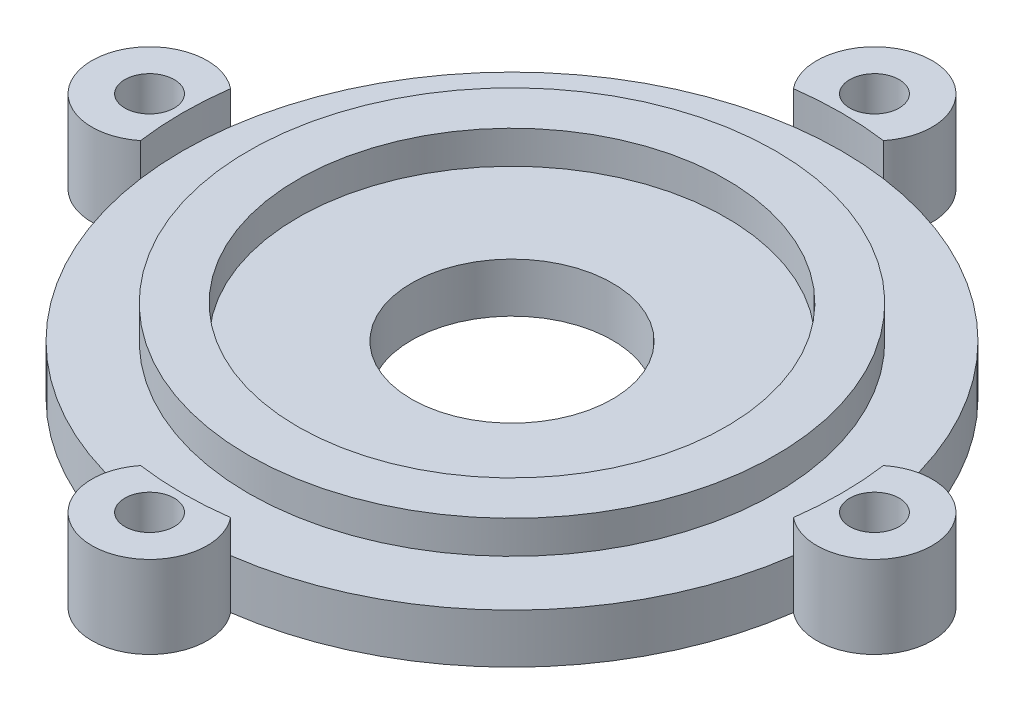
ISO-10303-21;
HEADER;
FILE_DESCRIPTION(('STEP AP214'),'2;1');
FILE_NAME('part.step','',(''),(''),'','','');
FILE_SCHEMA(('AUTOMOTIVE_DESIGN { 1 0 10303 214 1 1 1 1 }'));
ENDSEC;
DATA;
#1=APPLICATION_CONTEXT('core data for automotive mechanical design processes');
#2=APPLICATION_PROTOCOL_DEFINITION('international standard','automotive_design',2000,#1);
#3=PRODUCT_CONTEXT('',#1,'mechanical');
#4=PRODUCT('Part','Part','',(#3));
#5=PRODUCT_RELATED_PRODUCT_CATEGORY('part','',(#4));
#6=PRODUCT_DEFINITION_FORMATION('','',#4);
#7=PRODUCT_DEFINITION_CONTEXT('part definition',#1,'design');
#8=PRODUCT_DEFINITION('design','',#6,#7);
#9=PRODUCT_DEFINITION_SHAPE('','',#8);
#10=(LENGTH_UNIT() NAMED_UNIT(*) SI_UNIT(.MILLI.,.METRE.));
#11=(NAMED_UNIT(*) PLANE_ANGLE_UNIT() SI_UNIT($,.RADIAN.));
#12=(NAMED_UNIT(*) SI_UNIT($,.STERADIAN.) SOLID_ANGLE_UNIT());
#13=UNCERTAINTY_MEASURE_WITH_UNIT(LENGTH_MEASURE(1.E-05),#10,'distance_accuracy_value','');
#14=(GEOMETRIC_REPRESENTATION_CONTEXT(3) GLOBAL_UNCERTAINTY_ASSIGNED_CONTEXT((#13)) GLOBAL_UNIT_ASSIGNED_CONTEXT((#10,
#11,#12)) REPRESENTATION_CONTEXT('',''));
#15=CARTESIAN_POINT('',(0.,0.,0.));
#16=DIRECTION('',(0.,0.,1.));
#17=DIRECTION('',(1.,0.,0.));
#18=AXIS2_PLACEMENT_3D('',#15,#16,#17);
#19=CARTESIAN_POINT('',(0.,3.,0.));
#20=DIRECTION('',(0.,1.,0.));
#21=DIRECTION('',(0.,0.,1.));
#22=AXIS2_PLACEMENT_3D('',#19,#20,#21);
#23=PLANE('',#22);
#24=CARTESIAN_POINT('',(0.,3.,0.));
#25=DIRECTION('',(0.,1.,0.));
#26=DIRECTION('',(0.,0.,1.));
#27=AXIS2_PLACEMENT_3D('',#24,#25,#26);
#28=CIRCLE('',#27,16.);
#29=CARTESIAN_POINT('',(0.,3.,16.));
#30=VERTEX_POINT('',#29);
#31=EDGE_CURVE('E451',#30,#30,#28,.T.);
#32=ORIENTED_EDGE('',*,*,#31,.F.);
#33=EDGE_LOOP('',(#32));
#34=FACE_BOUND('',#33,.T.);
#35=CARTESIAN_POINT('',(0.,3.,0.));
#36=DIRECTION('',(0.,1.,0.));
#37=DIRECTION('',(0.,0.,1.));
#38=AXIS2_PLACEMENT_3D('',#35,#36,#37);
#39=CIRCLE('',#38,20.);
#40=CARTESIAN_POINT('',(-19.8125,3.,-2.73218662429926));
#41=VERTEX_POINT('',#40);
#42=CARTESIAN_POINT('',(-19.8125,3.,2.73218662429921));
#43=VERTEX_POINT('',#42);
#44=EDGE_CURVE('E103',#41,#43,#39,.T.);
#45=ORIENTED_EDGE('',*,*,#44,.T.);
#46=CARTESIAN_POINT('',(0.,3.,0.));
#47=DIRECTION('',(0.,1.,0.));
#48=DIRECTION('',(0.,0.,1.));
#49=AXIS2_PLACEMENT_3D('',#46,#47,#48);
#50=CIRCLE('',#49,20.);
#51=CARTESIAN_POINT('',(-2.73218662429929,3.,19.8125));
#52=VERTEX_POINT('',#51);
#53=EDGE_CURVE('E281',#43,#52,#50,.T.);
#54=ORIENTED_EDGE('',*,*,#53,.T.);
#55=CARTESIAN_POINT('',(0.,3.,0.));
#56=DIRECTION('',(0.,1.,0.));
#57=DIRECTION('',(0.,0.,1.));
#58=AXIS2_PLACEMENT_3D('',#55,#56,#57);
#59=CIRCLE('',#58,20.);
#60=CARTESIAN_POINT('',(2.73218662429922,3.,19.8125));
#61=VERTEX_POINT('',#60);
#62=EDGE_CURVE('E260',#52,#61,#59,.T.);
#63=ORIENTED_EDGE('',*,*,#62,.T.);
#64=CARTESIAN_POINT('',(19.8125,3.,2.73218662429931));
#65=VERTEX_POINT('',#64);
#66=EDGE_CURVE('E275',#61,#65,#50,.T.);
#67=ORIENTED_EDGE('',*,*,#66,.T.);
#68=CARTESIAN_POINT('',(0.,3.,0.));
#69=DIRECTION('',(0.,1.,0.));
#70=DIRECTION('',(0.,0.,1.));
#71=AXIS2_PLACEMENT_3D('',#68,#69,#70);
#72=CIRCLE('',#71,20.);
#73=CARTESIAN_POINT('',(19.8125,3.,-2.73218662429928));
#74=VERTEX_POINT('',#73);
#75=EDGE_CURVE('E238',#65,#74,#72,.T.);
#76=ORIENTED_EDGE('',*,*,#75,.T.);
#77=CARTESIAN_POINT('',(2.73218662429928,3.,-19.8125));
#78=VERTEX_POINT('',#77);
#79=EDGE_CURVE('E279',#74,#78,#50,.T.);
#80=ORIENTED_EDGE('',*,*,#79,.T.);
#81=CARTESIAN_POINT('',(0.,3.,0.));
#82=DIRECTION('',(0.,1.,0.));
#83=DIRECTION('',(0.,0.,1.));
#84=AXIS2_PLACEMENT_3D('',#81,#82,#83);
#85=CIRCLE('',#84,20.);
#86=CARTESIAN_POINT('',(-2.73218662429926,3.,-19.8125));
#87=VERTEX_POINT('',#86);
#88=EDGE_CURVE('E216',#78,#87,#85,.T.);
#89=ORIENTED_EDGE('',*,*,#88,.T.);
#90=EDGE_CURVE('E468',#87,#41,#50,.T.);
#91=ORIENTED_EDGE('',*,*,#90,.T.);
#92=EDGE_LOOP('',(#45,#54,#63,#67,#76,#80,#89,#91));
#93=FACE_BOUND('',#92,.T.);
#94=ADVANCED_FACE('F84',(#34,#93),#23,.T.);
#95=CARTESIAN_POINT('',(0.,3.,22.));
#96=DIRECTION('',(0.,-1.,0.));
#97=DIRECTION('',(0.,0.,-1.));
#98=AXIS2_PLACEMENT_3D('',#95,#96,#97);
#99=CYLINDRICAL_SURFACE('',#98,3.49999999999997);
#100=CARTESIAN_POINT('',(0.,0.,22.));
#101=DIRECTION('',(0.,1.,0.));
#102=DIRECTION('',(0.,0.,1.));
#103=AXIS2_PLACEMENT_3D('',#100,#101,#102);
#104=CIRCLE('',#103,3.49999999999997);
#105=CARTESIAN_POINT('',(2.73218662429922,0.,19.8125));
#106=VERTEX_POINT('',#105);
#107=CARTESIAN_POINT('',(-2.73218662429927,0.,19.8125));
#108=VERTEX_POINT('',#107);
#109=EDGE_CURVE('E285',#106,#108,#104,.F.);
#110=ORIENTED_EDGE('',*,*,#109,.F.);
#111=DIRECTION('',(0.,-1.,0.));
#112=VECTOR('',#111,1.);
#113=CARTESIAN_POINT('',(2.73218662429922,3.,19.8125));
#114=LINE('',#113,#112);
#115=EDGE_CURVE('E95',#61,#106,#114,.T.);
#116=ORIENTED_EDGE('',*,*,#115,.F.);
#117=DIRECTION('',(0.,-1.,0.));
#118=VECTOR('',#117,1.);
#119=CARTESIAN_POINT('',(2.73218662429925,5.,19.8125));
#120=LINE('',#119,#118);
#121=CARTESIAN_POINT('',(2.73218662429925,5.,19.8125));
#122=VERTEX_POINT('',#121);
#123=EDGE_CURVE('E149',#122,#61,#120,.T.);
#124=ORIENTED_EDGE('',*,*,#123,.F.);
#125=CARTESIAN_POINT('',(0.,5.,22.));
#126=DIRECTION('',(0.,1.,0.));
#127=DIRECTION('',(0.,0.,1.));
#128=AXIS2_PLACEMENT_3D('',#125,#126,#127);
#129=CIRCLE('',#128,3.49999999999997);
#130=CARTESIAN_POINT('',(-2.73218662429929,5.,19.8125));
#131=VERTEX_POINT('',#130);
#132=EDGE_CURVE('E261',#131,#122,#129,.T.);
#133=ORIENTED_EDGE('',*,*,#132,.F.);
#134=DIRECTION('',(0.,-1.,0.));
#135=VECTOR('',#134,1.);
#136=CARTESIAN_POINT('',(-2.73218662429929,5.,19.8125));
#137=LINE('',#136,#135);
#138=EDGE_CURVE('E267',#131,#52,#137,.T.);
#139=ORIENTED_EDGE('',*,*,#138,.T.);
#140=DIRECTION('',(0.,-1.,0.));
#141=VECTOR('',#140,1.);
#142=CARTESIAN_POINT('',(-2.73218662429927,3.,19.8125));
#143=LINE('',#142,#141);
#144=EDGE_CURVE('E142',#52,#108,#143,.T.);
#145=ORIENTED_EDGE('',*,*,#144,.T.);
#146=EDGE_LOOP('',(#110,#116,#124,#133,#139,#145));
#147=FACE_BOUND('',#146,.T.);
#148=ADVANCED_FACE('F350',(#147),#99,.T.);
#149=CARTESIAN_POINT('',(0.,3.,0.));
#150=DIRECTION('',(0.,-1.,0.));
#151=DIRECTION('',(0.,0.,-1.));
#152=AXIS2_PLACEMENT_3D('',#149,#150,#151);
#153=CYLINDRICAL_SURFACE('',#152,20.);
#154=CARTESIAN_POINT('',(0.,0.,0.));
#155=DIRECTION('',(0.,1.,0.));
#156=DIRECTION('',(0.,0.,1.));
#157=AXIS2_PLACEMENT_3D('',#154,#155,#156);
#158=CIRCLE('',#157,20.);
#159=CARTESIAN_POINT('',(19.8125,0.,2.73218662429931));
#160=VERTEX_POINT('',#159);
#161=EDGE_CURVE('E289',#106,#160,#158,.T.);
#162=ORIENTED_EDGE('',*,*,#161,.T.);
#163=DIRECTION('',(0.,-1.,0.));
#164=VECTOR('',#163,1.);
#165=CARTESIAN_POINT('',(19.8125,3.,2.73218662429931));
#166=LINE('',#165,#164);
#167=EDGE_CURVE('E335',#65,#160,#166,.T.);
#168=ORIENTED_EDGE('',*,*,#167,.F.);
#169=ORIENTED_EDGE('',*,*,#66,.F.);
#170=ORIENTED_EDGE('',*,*,#115,.T.);
#171=EDGE_LOOP('',(#162,#168,#169,#170));
#172=FACE_BOUND('',#171,.T.);
#173=ADVANCED_FACE('F343',(#172),#153,.T.);
#174=CARTESIAN_POINT('',(22.,3.,0.));
#175=DIRECTION('',(0.,-1.,0.));
#176=DIRECTION('',(0.,0.,-1.));
#177=AXIS2_PLACEMENT_3D('',#174,#175,#176);
#178=CYLINDRICAL_SURFACE('',#177,3.49999999999999);
#179=CARTESIAN_POINT('',(22.,0.,0.));
#180=DIRECTION('',(0.,1.,0.));
#181=DIRECTION('',(0.,0.,1.));
#182=AXIS2_PLACEMENT_3D('',#179,#180,#181);
#183=CIRCLE('',#182,3.49999999999999);
#184=CARTESIAN_POINT('',(19.8125,0.,-2.73218662429928));
#185=VERTEX_POINT('',#184);
#186=EDGE_CURVE('E293',#185,#160,#183,.F.);
#187=ORIENTED_EDGE('',*,*,#186,.F.);
#188=DIRECTION('',(0.,-1.,0.));
#189=VECTOR('',#188,1.);
#190=CARTESIAN_POINT('',(19.8125,3.,-2.73218662429928));
#191=LINE('',#190,#189);
#192=EDGE_CURVE('E332',#74,#185,#191,.T.);
#193=ORIENTED_EDGE('',*,*,#192,.F.);
#194=DIRECTION('',(0.,-1.,0.));
#195=VECTOR('',#194,1.);
#196=CARTESIAN_POINT('',(19.8125,5.,-2.73218662429928));
#197=LINE('',#196,#195);
#198=CARTESIAN_POINT('',(19.8125,5.,-2.73218662429928));
#199=VERTEX_POINT('',#198);
#200=EDGE_CURVE('E253',#199,#74,#197,.T.);
#201=ORIENTED_EDGE('',*,*,#200,.F.);
#202=CARTESIAN_POINT('',(22.,5.,0.));
#203=DIRECTION('',(0.,1.,0.));
#204=DIRECTION('',(0.,0.,1.));
#205=AXIS2_PLACEMENT_3D('',#202,#203,#204);
#206=CIRCLE('',#205,3.49999999999999);
#207=CARTESIAN_POINT('',(19.8125,5.,2.7321866242993));
#208=VERTEX_POINT('',#207);
#209=EDGE_CURVE('E239',#208,#199,#206,.T.);
#210=ORIENTED_EDGE('',*,*,#209,.F.);
#211=DIRECTION('',(0.,-1.,0.));
#212=VECTOR('',#211,1.);
#213=CARTESIAN_POINT('',(19.8125,5.,2.7321866242993));
#214=LINE('',#213,#212);
#215=EDGE_CURVE('E246',#208,#65,#214,.T.);
#216=ORIENTED_EDGE('',*,*,#215,.T.);
#217=ORIENTED_EDGE('',*,*,#167,.T.);
#218=EDGE_LOOP('',(#187,#193,#201,#210,#216,#217));
#219=FACE_BOUND('',#218,.T.);
#220=ADVANCED_FACE('F356',(#219),#178,.T.);
#221=CARTESIAN_POINT('',(2.73218662429928,0.,-19.8125));
#222=VERTEX_POINT('',#221);
#223=EDGE_CURVE('E295',#185,#222,#158,.T.);
#224=ORIENTED_EDGE('',*,*,#223,.T.);
#225=DIRECTION('',(0.,-1.,0.));
#226=VECTOR('',#225,1.);
#227=CARTESIAN_POINT('',(2.73218662429928,3.,-19.8125));
#228=LINE('',#227,#226);
#229=EDGE_CURVE('E329',#78,#222,#228,.T.);
#230=ORIENTED_EDGE('',*,*,#229,.F.);
#231=ORIENTED_EDGE('',*,*,#79,.F.);
#232=ORIENTED_EDGE('',*,*,#192,.T.);
#233=EDGE_LOOP('',(#224,#230,#231,#232));
#234=FACE_BOUND('',#233,.T.);
#235=ADVANCED_FACE('F358',(#234),#153,.T.);
#236=CARTESIAN_POINT('',(0.,3.,-22.));
#237=DIRECTION('',(0.,-1.,0.));
#238=DIRECTION('',(0.,0.,-1.));
#239=AXIS2_PLACEMENT_3D('',#236,#237,#238);
#240=CYLINDRICAL_SURFACE('',#239,3.49999999999997);
#241=CARTESIAN_POINT('',(0.,0.,-22.));
#242=DIRECTION('',(0.,1.,0.));
#243=DIRECTION('',(0.,0.,1.));
#244=AXIS2_PLACEMENT_3D('',#241,#242,#243);
#245=CIRCLE('',#244,3.49999999999997);
#246=CARTESIAN_POINT('',(-2.73218662429928,0.,-19.8125));
#247=VERTEX_POINT('',#246);
#248=EDGE_CURVE('E299',#247,#222,#245,.F.);
#249=ORIENTED_EDGE('',*,*,#248,.F.);
#250=DIRECTION('',(0.,-1.,0.));
#251=VECTOR('',#250,1.);
#252=CARTESIAN_POINT('',(-2.73218662429928,3.,-19.8125));
#253=LINE('',#252,#251);
#254=EDGE_CURVE('E326',#87,#247,#253,.T.);
#255=ORIENTED_EDGE('',*,*,#254,.F.);
#256=DIRECTION('',(0.,-1.,0.));
#257=VECTOR('',#256,1.);
#258=CARTESIAN_POINT('',(-2.73218662429926,5.,-19.8125));
#259=LINE('',#258,#257);
#260=CARTESIAN_POINT('',(-2.73218662429926,5.,-19.8125));
#261=VERTEX_POINT('',#260);
#262=EDGE_CURVE('E231',#261,#87,#259,.T.);
#263=ORIENTED_EDGE('',*,*,#262,.F.);
#264=CARTESIAN_POINT('',(0.,5.,-22.));
#265=DIRECTION('',(0.,1.,0.));
#266=DIRECTION('',(0.,0.,1.));
#267=AXIS2_PLACEMENT_3D('',#264,#265,#266);
#268=CIRCLE('',#267,3.49999999999997);
#269=CARTESIAN_POINT('',(2.73218662429927,5.,-19.8125));
#270=VERTEX_POINT('',#269);
#271=EDGE_CURVE('E217',#270,#261,#268,.T.);
#272=ORIENTED_EDGE('',*,*,#271,.F.);
#273=DIRECTION('',(0.,-1.,0.));
#274=VECTOR('',#273,1.);
#275=CARTESIAN_POINT('',(2.73218662429927,5.,-19.8125));
#276=LINE('',#275,#274);
#277=EDGE_CURVE('E224',#270,#78,#276,.T.);
#278=ORIENTED_EDGE('',*,*,#277,.T.);
#279=ORIENTED_EDGE('',*,*,#229,.T.);
#280=EDGE_LOOP('',(#249,#255,#263,#272,#278,#279));
#281=FACE_BOUND('',#280,.T.);
#282=ADVANCED_FACE('F367',(#281),#240,.T.);
#283=CARTESIAN_POINT('',(-19.8125,0.,-2.73218662429926));
#284=VERTEX_POINT('',#283);
#285=EDGE_CURVE('E303',#247,#284,#158,.T.);
#286=ORIENTED_EDGE('',*,*,#285,.T.);
#287=DIRECTION('',(0.,-1.,0.));
#288=VECTOR('',#287,1.);
#289=CARTESIAN_POINT('',(-19.8125,3.,-2.73218662429926));
#290=LINE('',#289,#288);
#291=EDGE_CURVE('E323',#41,#284,#290,.T.);
#292=ORIENTED_EDGE('',*,*,#291,.F.);
#293=ORIENTED_EDGE('',*,*,#90,.F.);
#294=ORIENTED_EDGE('',*,*,#254,.T.);
#295=EDGE_LOOP('',(#286,#292,#293,#294));
#296=FACE_BOUND('',#295,.T.);
#297=ADVANCED_FACE('F370',(#296),#153,.T.);
#298=CARTESIAN_POINT('',(-22.,3.,0.));
#299=DIRECTION('',(0.,-1.,0.));
#300=DIRECTION('',(0.,0.,-1.));
#301=AXIS2_PLACEMENT_3D('',#298,#299,#300);
#302=CYLINDRICAL_SURFACE('',#301,3.49999999999997);
#303=CARTESIAN_POINT('',(-22.,0.,0.));
#304=DIRECTION('',(0.,1.,0.));
#305=DIRECTION('',(0.,0.,1.));
#306=AXIS2_PLACEMENT_3D('',#303,#304,#305);
#307=CIRCLE('',#306,3.49999999999997);
#308=CARTESIAN_POINT('',(-19.8125,0.,2.73218662429923));
#309=VERTEX_POINT('',#308);
#310=EDGE_CURVE('E304',#309,#284,#307,.F.);
#311=ORIENTED_EDGE('',*,*,#310,.F.);
#312=DIRECTION('',(0.,-1.,0.));
#313=VECTOR('',#312,1.);
#314=CARTESIAN_POINT('',(-19.8125,3.,2.73218662429923));
#315=LINE('',#314,#313);
#316=EDGE_CURVE('E134',#43,#309,#315,.T.);
#317=ORIENTED_EDGE('',*,*,#316,.F.);
#318=DIRECTION('',(0.,-1.,0.));
#319=VECTOR('',#318,1.);
#320=CARTESIAN_POINT('',(-19.8125,5.,2.73218662429921));
#321=LINE('',#320,#319);
#322=CARTESIAN_POINT('',(-19.8125,5.,2.73218662429921));
#323=VERTEX_POINT('',#322);
#324=EDGE_CURVE('E196',#323,#43,#321,.T.);
#325=ORIENTED_EDGE('',*,*,#324,.F.);
#326=CARTESIAN_POINT('',(-22.,5.,0.));
#327=DIRECTION('',(0.,1.,0.));
#328=DIRECTION('',(0.,0.,1.));
#329=AXIS2_PLACEMENT_3D('',#326,#327,#328);
#330=CIRCLE('',#329,3.49999999999997);
#331=CARTESIAN_POINT('',(-19.8125,5.,-2.73218662429925));
#332=VERTEX_POINT('',#331);
#333=EDGE_CURVE('E187',#332,#323,#330,.T.);
#334=ORIENTED_EDGE('',*,*,#333,.F.);
#335=DIRECTION('',(0.,-1.,0.));
#336=VECTOR('',#335,1.);
#337=CARTESIAN_POINT('',(-19.8125,5.,-2.73218662429925));
#338=LINE('',#337,#336);
#339=EDGE_CURVE('E201',#332,#41,#338,.T.);
#340=ORIENTED_EDGE('',*,*,#339,.T.);
#341=ORIENTED_EDGE('',*,*,#291,.T.);
#342=EDGE_LOOP('',(#311,#317,#325,#334,#340,#341));
#343=FACE_BOUND('',#342,.T.);
#344=ADVANCED_FACE('F198',(#343),#302,.T.);
#345=CARTESIAN_POINT('',(0.,3.,-22.));
#346=DIRECTION('',(0.,-1.,0.));
#347=DIRECTION('',(0.,0.,-1.));
#348=AXIS2_PLACEMENT_3D('',#345,#346,#347);
#349=CYLINDRICAL_SURFACE('',#348,1.5);
#350=CARTESIAN_POINT('',(0.,0.,-22.));
#351=DIRECTION('',(0.,1.,0.));
#352=DIRECTION('',(0.,0.,1.));
#353=AXIS2_PLACEMENT_3D('',#350,#351,#352);
#354=CIRCLE('',#353,1.5);
#355=CARTESIAN_POINT('',(0.,0.,-20.5));
#356=VERTEX_POINT('',#355);
#357=EDGE_CURVE('E312',#356,#356,#354,.T.);
#358=ORIENTED_EDGE('',*,*,#357,.F.);
#359=EDGE_LOOP('',(#358));
#360=FACE_BOUND('',#359,.T.);
#361=CARTESIAN_POINT('',(0.,5.,-22.));
#362=DIRECTION('',(0.,1.,0.));
#363=DIRECTION('',(0.,0.,1.));
#364=AXIS2_PLACEMENT_3D('',#361,#362,#363);
#365=CIRCLE('',#364,1.5);
#366=CARTESIAN_POINT('',(0.,5.,-20.5));
#367=VERTEX_POINT('',#366);
#368=EDGE_CURVE('E200',#367,#367,#365,.T.);
#369=ORIENTED_EDGE('',*,*,#368,.T.);
#370=EDGE_LOOP('',(#369));
#371=FACE_BOUND('',#370,.T.);
#372=ADVANCED_FACE('F373',(#360,#371),#349,.F.);
#373=CARTESIAN_POINT('',(-22.,3.,0.));
#374=DIRECTION('',(0.,-1.,0.));
#375=DIRECTION('',(0.,0.,-1.));
#376=AXIS2_PLACEMENT_3D('',#373,#374,#375);
#377=CYLINDRICAL_SURFACE('',#376,1.49999999999997);
#378=CARTESIAN_POINT('',(-22.,0.,0.));
#379=DIRECTION('',(0.,1.,0.));
#380=DIRECTION('',(0.,0.,1.));
#381=AXIS2_PLACEMENT_3D('',#378,#379,#380);
#382=CIRCLE('',#381,1.49999999999997);
#383=CARTESIAN_POINT('',(-22.,0.,1.49999999999995));
#384=VERTEX_POINT('',#383);
#385=EDGE_CURVE('E308',#384,#384,#382,.T.);
#386=ORIENTED_EDGE('',*,*,#385,.F.);
#387=EDGE_LOOP('',(#386));
#388=FACE_BOUND('',#387,.T.);
#389=CARTESIAN_POINT('',(-22.,5.,0.));
#390=DIRECTION('',(0.,1.,0.));
#391=DIRECTION('',(0.,0.,1.));
#392=AXIS2_PLACEMENT_3D('',#389,#390,#391);
#393=CIRCLE('',#392,1.49999999999997);
#394=CARTESIAN_POINT('',(-22.,5.,1.49999999999995));
#395=VERTEX_POINT('',#394);
#396=EDGE_CURVE('E211',#395,#395,#393,.T.);
#397=ORIENTED_EDGE('',*,*,#396,.T.);
#398=EDGE_LOOP('',(#397));
#399=FACE_BOUND('',#398,.T.);
#400=ADVANCED_FACE('F376',(#388,#399),#377,.F.);
#401=EDGE_CURVE('E294',#309,#108,#158,.T.);
#402=ORIENTED_EDGE('',*,*,#401,.T.);
#403=ORIENTED_EDGE('',*,*,#144,.F.);
#404=ORIENTED_EDGE('',*,*,#53,.F.);
#405=ORIENTED_EDGE('',*,*,#316,.T.);
#406=EDGE_LOOP('',(#402,#403,#404,#405));
#407=FACE_BOUND('',#406,.T.);
#408=ADVANCED_FACE('F359',(#407),#153,.T.);
#409=CARTESIAN_POINT('',(0.,3.,22.));
#410=DIRECTION('',(0.,-1.,0.));
#411=DIRECTION('',(0.,0.,-1.));
#412=AXIS2_PLACEMENT_3D('',#409,#410,#411);
#413=CYLINDRICAL_SURFACE('',#412,1.5);
#414=CARTESIAN_POINT('',(0.,0.,22.));
#415=DIRECTION('',(0.,1.,0.));
#416=DIRECTION('',(0.,0.,1.));
#417=AXIS2_PLACEMENT_3D('',#414,#415,#416);
#418=CIRCLE('',#417,1.5);
#419=CARTESIAN_POINT('',(0.,0.,23.5));
#420=VERTEX_POINT('',#419);
#421=EDGE_CURVE('E274',#420,#420,#418,.T.);
#422=ORIENTED_EDGE('',*,*,#421,.F.);
#423=EDGE_LOOP('',(#422));
#424=FACE_BOUND('',#423,.T.);
#425=CARTESIAN_POINT('',(0.,5.,22.));
#426=DIRECTION('',(0.,1.,0.));
#427=DIRECTION('',(0.,0.,1.));
#428=AXIS2_PLACEMENT_3D('',#425,#426,#427);
#429=CIRCLE('',#428,1.5);
#430=CARTESIAN_POINT('',(0.,5.,23.5));
#431=VERTEX_POINT('',#430);
#432=EDGE_CURVE('E256',#431,#431,#429,.T.);
#433=ORIENTED_EDGE('',*,*,#432,.T.);
#434=EDGE_LOOP('',(#433));
#435=FACE_BOUND('',#434,.T.);
#436=ADVANCED_FACE('F86',(#424,#435),#413,.F.);
#437=CARTESIAN_POINT('',(22.,3.,0.));
#438=DIRECTION('',(0.,-1.,0.));
#439=DIRECTION('',(0.,0.,-1.));
#440=AXIS2_PLACEMENT_3D('',#437,#438,#439);
#441=CYLINDRICAL_SURFACE('',#440,1.5);
#442=CARTESIAN_POINT('',(22.,0.,0.));
#443=DIRECTION('',(0.,1.,0.));
#444=DIRECTION('',(0.,0.,1.));
#445=AXIS2_PLACEMENT_3D('',#442,#443,#444);
#446=CIRCLE('',#445,1.5);
#447=CARTESIAN_POINT('',(22.,0.,1.50000000000001));
#448=VERTEX_POINT('',#447);
#449=EDGE_CURVE('E280',#448,#448,#446,.T.);
#450=ORIENTED_EDGE('',*,*,#449,.F.);
#451=EDGE_LOOP('',(#450));
#452=FACE_BOUND('',#451,.T.);
#453=CARTESIAN_POINT('',(22.,5.,0.));
#454=DIRECTION('',(0.,1.,0.));
#455=DIRECTION('',(0.,0.,1.));
#456=AXIS2_PLACEMENT_3D('',#453,#454,#455);
#457=CIRCLE('',#456,1.5);
#458=CARTESIAN_POINT('',(22.,5.,1.50000000000001));
#459=VERTEX_POINT('',#458);
#460=EDGE_CURVE('E234',#459,#459,#457,.T.);
#461=ORIENTED_EDGE('',*,*,#460,.T.);
#462=EDGE_LOOP('',(#461));
#463=FACE_BOUND('',#462,.T.);
#464=ADVANCED_FACE('F383',(#452,#463),#441,.F.);
#465=CARTESIAN_POINT('',(0.,0.,0.));
#466=DIRECTION('',(0.,1.,0.));
#467=DIRECTION('',(0.,0.,1.));
#468=AXIS2_PLACEMENT_3D('',#465,#466,#467);
#469=PLANE('',#468);
#470=CARTESIAN_POINT('',(0.,0.,0.));
#471=DIRECTION('',(0.,1.,0.));
#472=DIRECTION('',(0.,0.,1.));
#473=AXIS2_PLACEMENT_3D('',#470,#471,#472);
#474=CIRCLE('',#473,6.09999999999998);
#475=CARTESIAN_POINT('',(0.,0.,6.09999999999998));
#476=VERTEX_POINT('',#475);
#477=EDGE_CURVE('E442',#476,#476,#474,.T.);
#478=ORIENTED_EDGE('',*,*,#477,.T.);
#479=EDGE_LOOP('',(#478));
#480=FACE_BOUND('',#479,.T.);
#481=ORIENTED_EDGE('',*,*,#421,.T.);
#482=EDGE_LOOP('',(#481));
#483=FACE_BOUND('',#482,.T.);
#484=ORIENTED_EDGE('',*,*,#109,.T.);
#485=ORIENTED_EDGE('',*,*,#401,.F.);
#486=ORIENTED_EDGE('',*,*,#310,.T.);
#487=ORIENTED_EDGE('',*,*,#285,.F.);
#488=ORIENTED_EDGE('',*,*,#248,.T.);
#489=ORIENTED_EDGE('',*,*,#223,.F.);
#490=ORIENTED_EDGE('',*,*,#186,.T.);
#491=ORIENTED_EDGE('',*,*,#161,.F.);
#492=EDGE_LOOP('',(#484,#485,#486,#487,#488,#489,#490,#491));
#493=FACE_BOUND('',#492,.T.);
#494=ORIENTED_EDGE('',*,*,#385,.T.);
#495=EDGE_LOOP('',(#494));
#496=FACE_BOUND('',#495,.T.);
#497=ORIENTED_EDGE('',*,*,#357,.T.);
#498=EDGE_LOOP('',(#497));
#499=FACE_BOUND('',#498,.T.);
#500=ORIENTED_EDGE('',*,*,#449,.T.);
#501=EDGE_LOOP('',(#500));
#502=FACE_BOUND('',#501,.T.);
#503=ADVANCED_FACE('F346',(#480,#483,#493,#496,#499,#502),#469,.F.);
#504=CARTESIAN_POINT('',(0.,5.,11.));
#505=DIRECTION('',(0.,1.,0.));
#506=DIRECTION('',(0.,0.,1.));
#507=AXIS2_PLACEMENT_3D('',#504,#505,#506);
#508=PLANE('',#507);
#509=ORIENTED_EDGE('',*,*,#132,.T.);
#510=CARTESIAN_POINT('',(0.,5.,0.));
#511=DIRECTION('',(0.,1.,0.));
#512=DIRECTION('',(0.,0.,1.));
#513=AXIS2_PLACEMENT_3D('',#510,#511,#512);
#514=CIRCLE('',#513,20.);
#515=EDGE_CURVE('E264',#131,#122,#514,.T.);
#516=ORIENTED_EDGE('',*,*,#515,.F.);
#517=EDGE_LOOP('',(#509,#516));
#518=FACE_BOUND('',#517,.T.);
#519=ORIENTED_EDGE('',*,*,#432,.F.);
#520=EDGE_LOOP('',(#519));
#521=FACE_BOUND('',#520,.T.);
#522=ADVANCED_FACE('F388',(#518,#521),#508,.T.);
#523=CARTESIAN_POINT('',(0.,5.,0.));
#524=DIRECTION('',(0.,-1.,0.));
#525=DIRECTION('',(0.,0.,-1.));
#526=AXIS2_PLACEMENT_3D('',#523,#524,#525);
#527=CYLINDRICAL_SURFACE('',#526,20.);
#528=ORIENTED_EDGE('',*,*,#62,.F.);
#529=ORIENTED_EDGE('',*,*,#138,.F.);
#530=ORIENTED_EDGE('',*,*,#515,.T.);
#531=ORIENTED_EDGE('',*,*,#123,.T.);
#532=EDGE_LOOP('',(#528,#529,#530,#531));
#533=FACE_BOUND('',#532,.T.);
#534=ADVANCED_FACE('F391',(#533),#527,.F.);
#535=CARTESIAN_POINT('',(11.,5.,0.));
#536=DIRECTION('',(0.,1.,0.));
#537=DIRECTION('',(0.,0.,1.));
#538=AXIS2_PLACEMENT_3D('',#535,#536,#537);
#539=PLANE('',#538);
#540=ORIENTED_EDGE('',*,*,#209,.T.);
#541=CARTESIAN_POINT('',(0.,5.,0.));
#542=DIRECTION('',(0.,1.,0.));
#543=DIRECTION('',(0.,0.,1.));
#544=AXIS2_PLACEMENT_3D('',#541,#542,#543);
#545=CIRCLE('',#544,20.);
#546=EDGE_CURVE('E242',#208,#199,#545,.T.);
#547=ORIENTED_EDGE('',*,*,#546,.F.);
#548=EDGE_LOOP('',(#540,#547));
#549=FACE_BOUND('',#548,.T.);
#550=ORIENTED_EDGE('',*,*,#460,.F.);
#551=EDGE_LOOP('',(#550));
#552=FACE_BOUND('',#551,.T.);
#553=ADVANCED_FACE('F394',(#549,#552),#539,.T.);
#554=CARTESIAN_POINT('',(0.,5.,0.));
#555=DIRECTION('',(0.,-1.,0.));
#556=DIRECTION('',(0.,0.,-1.));
#557=AXIS2_PLACEMENT_3D('',#554,#555,#556);
#558=CYLINDRICAL_SURFACE('',#557,20.);
#559=ORIENTED_EDGE('',*,*,#75,.F.);
#560=ORIENTED_EDGE('',*,*,#215,.F.);
#561=ORIENTED_EDGE('',*,*,#546,.T.);
#562=ORIENTED_EDGE('',*,*,#200,.T.);
#563=EDGE_LOOP('',(#559,#560,#561,#562));
#564=FACE_BOUND('',#563,.T.);
#565=ADVANCED_FACE('F398',(#564),#558,.F.);
#566=CARTESIAN_POINT('',(0.,5.,-11.));
#567=DIRECTION('',(0.,1.,0.));
#568=DIRECTION('',(0.,0.,1.));
#569=AXIS2_PLACEMENT_3D('',#566,#567,#568);
#570=PLANE('',#569);
#571=ORIENTED_EDGE('',*,*,#271,.T.);
#572=CARTESIAN_POINT('',(0.,5.,0.));
#573=DIRECTION('',(0.,1.,0.));
#574=DIRECTION('',(0.,0.,1.));
#575=AXIS2_PLACEMENT_3D('',#572,#573,#574);
#576=CIRCLE('',#575,20.);
#577=EDGE_CURVE('E220',#270,#261,#576,.T.);
#578=ORIENTED_EDGE('',*,*,#577,.F.);
#579=EDGE_LOOP('',(#571,#578));
#580=FACE_BOUND('',#579,.T.);
#581=ORIENTED_EDGE('',*,*,#368,.F.);
#582=EDGE_LOOP('',(#581));
#583=FACE_BOUND('',#582,.T.);
#584=ADVANCED_FACE('F401',(#580,#583),#570,.T.);
#585=CARTESIAN_POINT('',(0.,5.,0.));
#586=DIRECTION('',(0.,-1.,0.));
#587=DIRECTION('',(0.,0.,-1.));
#588=AXIS2_PLACEMENT_3D('',#585,#586,#587);
#589=CYLINDRICAL_SURFACE('',#588,20.);
#590=ORIENTED_EDGE('',*,*,#88,.F.);
#591=ORIENTED_EDGE('',*,*,#277,.F.);
#592=ORIENTED_EDGE('',*,*,#577,.T.);
#593=ORIENTED_EDGE('',*,*,#262,.T.);
#594=EDGE_LOOP('',(#590,#591,#592,#593));
#595=FACE_BOUND('',#594,.T.);
#596=ADVANCED_FACE('F406',(#595),#589,.F.);
#597=CARTESIAN_POINT('',(-11.,5.,0.));
#598=DIRECTION('',(0.,1.,0.));
#599=DIRECTION('',(0.,0.,1.));
#600=AXIS2_PLACEMENT_3D('',#597,#598,#599);
#601=PLANE('',#600);
#602=ORIENTED_EDGE('',*,*,#333,.T.);
#603=CARTESIAN_POINT('',(0.,5.,0.));
#604=DIRECTION('',(0.,1.,0.));
#605=DIRECTION('',(0.,0.,1.));
#606=AXIS2_PLACEMENT_3D('',#603,#604,#605);
#607=CIRCLE('',#606,20.);
#608=EDGE_CURVE('E192',#332,#323,#607,.T.);
#609=ORIENTED_EDGE('',*,*,#608,.F.);
#610=EDGE_LOOP('',(#602,#609));
#611=FACE_BOUND('',#610,.T.);
#612=ORIENTED_EDGE('',*,*,#396,.F.);
#613=EDGE_LOOP('',(#612));
#614=FACE_BOUND('',#613,.T.);
#615=ADVANCED_FACE('F189',(#611,#614),#601,.T.);
#616=CARTESIAN_POINT('',(0.,5.,0.));
#617=DIRECTION('',(0.,-1.,0.));
#618=DIRECTION('',(0.,0.,-1.));
#619=AXIS2_PLACEMENT_3D('',#616,#617,#618);
#620=CYLINDRICAL_SURFACE('',#619,20.);
#621=ORIENTED_EDGE('',*,*,#44,.F.);
#622=ORIENTED_EDGE('',*,*,#339,.F.);
#623=ORIENTED_EDGE('',*,*,#608,.T.);
#624=ORIENTED_EDGE('',*,*,#324,.T.);
#625=EDGE_LOOP('',(#621,#622,#623,#624));
#626=FACE_BOUND('',#625,.T.);
#627=ADVANCED_FACE('F203',(#626),#620,.F.);
#628=CARTESIAN_POINT('',(0.,5.,0.));
#629=DIRECTION('',(0.,1.,0.));
#630=DIRECTION('',(0.,0.,1.));
#631=AXIS2_PLACEMENT_3D('',#628,#629,#630);
#632=PLANE('',#631);
#633=CARTESIAN_POINT('',(0.,5.,0.));
#634=DIRECTION('',(0.,1.,0.));
#635=DIRECTION('',(0.,0.,1.));
#636=AXIS2_PLACEMENT_3D('',#633,#634,#635);
#637=CIRCLE('',#636,16.);
#638=CARTESIAN_POINT('',(0.,5.,16.));
#639=VERTEX_POINT('',#638);
#640=EDGE_CURVE('E452',#639,#639,#637,.T.);
#641=ORIENTED_EDGE('',*,*,#640,.T.);
#642=EDGE_LOOP('',(#641));
#643=FACE_BOUND('',#642,.T.);
#644=CARTESIAN_POINT('',(0.,5.,0.));
#645=DIRECTION('',(0.,1.,0.));
#646=DIRECTION('',(0.,0.,1.));
#647=AXIS2_PLACEMENT_3D('',#644,#645,#646);
#648=CIRCLE('',#647,13.);
#649=CARTESIAN_POINT('',(0.,5.,13.));
#650=VERTEX_POINT('',#649);
#651=EDGE_CURVE('E446',#650,#650,#648,.T.);
#652=ORIENTED_EDGE('',*,*,#651,.F.);
#653=EDGE_LOOP('',(#652));
#654=FACE_BOUND('',#653,.T.);
#655=ADVANCED_FACE('F415',(#643,#654),#632,.T.);
#656=CARTESIAN_POINT('',(0.,5.,0.));
#657=DIRECTION('',(0.,-1.,0.));
#658=DIRECTION('',(0.,0.,-1.));
#659=AXIS2_PLACEMENT_3D('',#656,#657,#658);
#660=CYLINDRICAL_SURFACE('',#659,16.);
#661=ORIENTED_EDGE('',*,*,#640,.F.);
#662=EDGE_LOOP('',(#661));
#663=FACE_BOUND('',#662,.T.);
#664=ORIENTED_EDGE('',*,*,#31,.T.);
#665=EDGE_LOOP('',(#664));
#666=FACE_BOUND('',#665,.T.);
#667=ADVANCED_FACE('F418',(#663,#666),#660,.T.);
#668=CARTESIAN_POINT('',(0.,5.,0.));
#669=DIRECTION('',(0.,-1.,0.));
#670=DIRECTION('',(0.,0.,-1.));
#671=AXIS2_PLACEMENT_3D('',#668,#669,#670);
#672=CYLINDRICAL_SURFACE('',#671,13.);
#673=ORIENTED_EDGE('',*,*,#651,.T.);
#674=EDGE_LOOP('',(#673));
#675=FACE_BOUND('',#674,.T.);
#676=CARTESIAN_POINT('',(0.,3.,0.));
#677=DIRECTION('',(0.,1.,0.));
#678=DIRECTION('',(0.,0.,1.));
#679=AXIS2_PLACEMENT_3D('',#676,#677,#678);
#680=CIRCLE('',#679,13.);
#681=CARTESIAN_POINT('',(0.,3.,13.));
#682=VERTEX_POINT('',#681);
#683=EDGE_CURVE('E12',#682,#682,#680,.F.);
#684=ORIENTED_EDGE('',*,*,#683,.T.);
#685=EDGE_LOOP('',(#684));
#686=FACE_BOUND('',#685,.T.);
#687=ADVANCED_FACE('F421',(#675,#686),#672,.F.);
#688=CARTESIAN_POINT('',(0.,3.,0.));
#689=DIRECTION('',(0.,1.,0.));
#690=DIRECTION('',(0.,0.,1.));
#691=AXIS2_PLACEMENT_3D('',#688,#689,#690);
#692=CIRCLE('',#691,6.09999999999998);
#693=CARTESIAN_POINT('',(0.,3.,6.09999999999998));
#694=VERTEX_POINT('',#693);
#695=EDGE_CURVE('E88',#694,#694,#692,.F.);
#696=ORIENTED_EDGE('',*,*,#695,.T.);
#697=EDGE_LOOP('',(#696));
#698=FACE_BOUND('',#697,.T.);
#699=ORIENTED_EDGE('',*,*,#683,.F.);
#700=EDGE_LOOP('',(#699));
#701=FACE_BOUND('',#700,.T.);
#702=ADVANCED_FACE('F362',(#698,#701),#23,.T.);
#703=CARTESIAN_POINT('',(0.,10.,0.));
#704=DIRECTION('',(0.,-1.,0.));
#705=DIRECTION('',(0.,0.,-1.));
#706=AXIS2_PLACEMENT_3D('',#703,#704,#705);
#707=CYLINDRICAL_SURFACE('',#706,6.09999999999998);
#708=ORIENTED_EDGE('',*,*,#695,.F.);
#709=EDGE_LOOP('',(#708));
#710=FACE_BOUND('',#709,.T.);
#711=ORIENTED_EDGE('',*,*,#477,.F.);
#712=EDGE_LOOP('',(#711));
#713=FACE_BOUND('',#712,.T.);
#714=ADVANCED_FACE('F429',(#710,#713),#707,.F.);
#715=CLOSED_SHELL('',(#94,#148,#173,#220,#235,#282,#297,#344,#372,#400,#408,#436,#464,#503,#522,
#534,#553,#565,#584,#596,#615,#627,#655,#667,#687,#702,#714));
#716=MANIFOLD_SOLID_BREP('B2',#715);
#717=ADVANCED_BREP_SHAPE_REPRESENTATION('',(#18,#716),#14);
#718=SHAPE_DEFINITION_REPRESENTATION(#9,#717);
ENDSEC;
END-ISO-10303-21;
